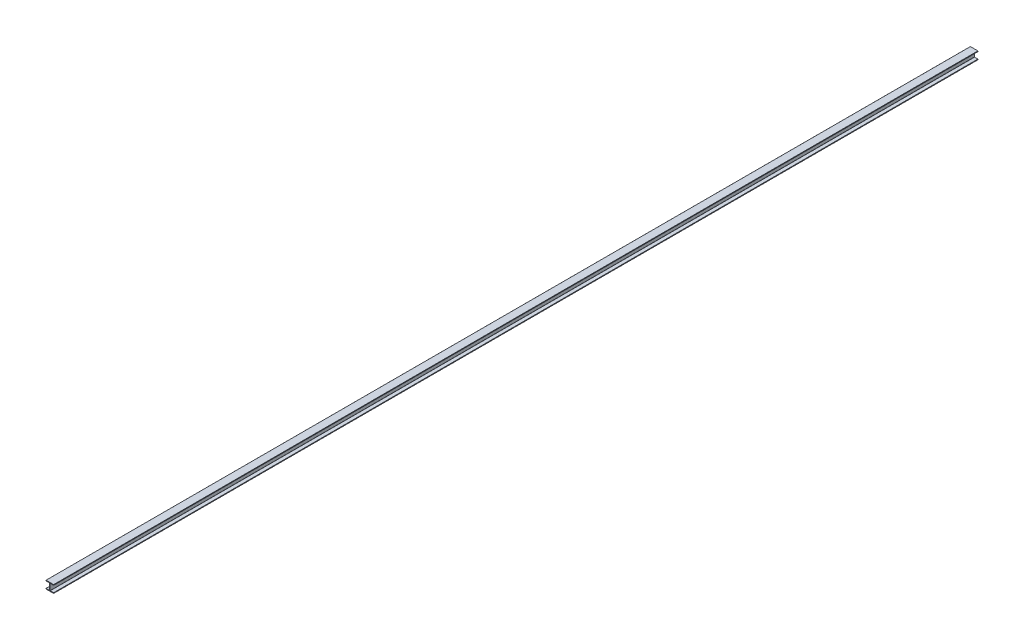
ISO-10303-21;
HEADER;
FILE_DESCRIPTION(('STEP AP214'),'2;1');
FILE_NAME('part.step','',(''),(''),'','','');
FILE_SCHEMA(('AUTOMOTIVE_DESIGN { 1 0 10303 214 1 1 1 1 }'));
ENDSEC;
DATA;
#1=APPLICATION_CONTEXT('core data for automotive mechanical design processes');
#2=APPLICATION_PROTOCOL_DEFINITION('international standard','automotive_design',2000,#1);
#3=PRODUCT_CONTEXT('',#1,'mechanical');
#4=PRODUCT('Part','Part','',(#3));
#5=PRODUCT_RELATED_PRODUCT_CATEGORY('part','',(#4));
#6=PRODUCT_DEFINITION_FORMATION('','',#4);
#7=PRODUCT_DEFINITION_CONTEXT('part definition',#1,'design');
#8=PRODUCT_DEFINITION('design','',#6,#7);
#9=PRODUCT_DEFINITION_SHAPE('','',#8);
#10=(LENGTH_UNIT() NAMED_UNIT(*) SI_UNIT(.MILLI.,.METRE.));
#11=(NAMED_UNIT(*) PLANE_ANGLE_UNIT() SI_UNIT($,.RADIAN.));
#12=(NAMED_UNIT(*) SI_UNIT($,.STERADIAN.) SOLID_ANGLE_UNIT());
#13=UNCERTAINTY_MEASURE_WITH_UNIT(LENGTH_MEASURE(1.E-05),#10,'distance_accuracy_value','');
#14=(GEOMETRIC_REPRESENTATION_CONTEXT(3) GLOBAL_UNCERTAINTY_ASSIGNED_CONTEXT((#13)) GLOBAL_UNIT_ASSIGNED_CONTEXT((#10,
#11,#12)) REPRESENTATION_CONTEXT('',''));
#15=CARTESIAN_POINT('',(0.,0.,0.));
#16=DIRECTION('',(0.,0.,1.));
#17=DIRECTION('',(1.,0.,0.));
#18=AXIS2_PLACEMENT_3D('',#15,#16,#17);
#19=CARTESIAN_POINT('',(-61.976,-61.976,7620.));
#20=DIRECTION('',(0.,0.,-1.));
#21=DIRECTION('',(-1.,0.,0.));
#22=AXIS2_PLACEMENT_3D('',#19,#20,#21);
#23=CYLINDRICAL_SURFACE('',#22,1.52400000000001);
#24=CARTESIAN_POINT('',(-61.976,-61.976,-7620.));
#25=DIRECTION('',(0.,0.,1.));
#26=DIRECTION('',(1.,0.,0.));
#27=AXIS2_PLACEMENT_3D('',#24,#25,#26);
#28=CIRCLE('',#27,1.52400000000001);
#29=CARTESIAN_POINT('',(-63.5,-61.976,-7620.));
#30=VERTEX_POINT('',#29);
#31=CARTESIAN_POINT('',(-61.976,-63.5,-7620.));
#32=VERTEX_POINT('',#31);
#33=EDGE_CURVE('E225',#30,#32,#28,.T.);
#34=ORIENTED_EDGE('',*,*,#33,.T.);
#35=DIRECTION('',(0.,0.,-1.));
#36=VECTOR('',#35,1.);
#37=CARTESIAN_POINT('',(-61.976,-63.5,7620.));
#38=LINE('',#37,#36);
#39=CARTESIAN_POINT('',(-61.976,-63.5,7620.));
#40=VERTEX_POINT('',#39);
#41=EDGE_CURVE('E11',#40,#32,#38,.T.);
#42=ORIENTED_EDGE('',*,*,#41,.F.);
#43=CARTESIAN_POINT('',(-61.976,-61.976,7620.));
#44=DIRECTION('',(0.,0.,1.));
#45=DIRECTION('',(1.,0.,0.));
#46=AXIS2_PLACEMENT_3D('',#43,#44,#45);
#47=CIRCLE('',#46,1.52400000000001);
#48=CARTESIAN_POINT('',(-63.5,-61.976,7620.));
#49=VERTEX_POINT('',#48);
#50=EDGE_CURVE('E271',#49,#40,#47,.T.);
#51=ORIENTED_EDGE('',*,*,#50,.F.);
#52=DIRECTION('',(0.,0.,-1.));
#53=VECTOR('',#52,1.);
#54=CARTESIAN_POINT('',(-63.5,-61.976,7620.));
#55=LINE('',#54,#53);
#56=EDGE_CURVE('E221',#49,#30,#55,.T.);
#57=ORIENTED_EDGE('',*,*,#56,.T.);
#58=EDGE_LOOP('',(#34,#42,#51,#57));
#59=FACE_BOUND('',#58,.T.);
#60=ADVANCED_FACE('F33',(#59),#23,.T.);
#61=CARTESIAN_POINT('',(61.976,-63.5,7620.));
#62=DIRECTION('',(0.,1.,0.));
#63=DIRECTION('',(-1.,0.,0.));
#64=AXIS2_PLACEMENT_3D('',#61,#62,#63);
#65=PLANE('',#64);
#66=DIRECTION('',(1.,0.,0.));
#67=VECTOR('',#66,1.);
#68=CARTESIAN_POINT('',(61.976,-63.5,-7620.));
#69=LINE('',#68,#67);
#70=CARTESIAN_POINT('',(61.976,-63.5,-7620.));
#71=VERTEX_POINT('',#70);
#72=EDGE_CURVE('E228',#32,#71,#69,.T.);
#73=ORIENTED_EDGE('',*,*,#72,.T.);
#74=DIRECTION('',(0.,0.,-1.));
#75=VECTOR('',#74,1.);
#76=CARTESIAN_POINT('',(61.976,-63.5,7620.));
#77=LINE('',#76,#75);
#78=CARTESIAN_POINT('',(61.976,-63.5,7620.));
#79=VERTEX_POINT('',#78);
#80=EDGE_CURVE('E41',#79,#71,#77,.T.);
#81=ORIENTED_EDGE('',*,*,#80,.F.);
#82=DIRECTION('',(1.,0.,0.));
#83=VECTOR('',#82,1.);
#84=CARTESIAN_POINT('',(61.976,-63.5,7620.));
#85=LINE('',#84,#83);
#86=EDGE_CURVE('E140',#40,#79,#85,.T.);
#87=ORIENTED_EDGE('',*,*,#86,.F.);
#88=ORIENTED_EDGE('',*,*,#41,.T.);
#89=EDGE_LOOP('',(#73,#81,#87,#88));
#90=FACE_BOUND('',#89,.T.);
#91=ADVANCED_FACE('F409',(#90),#65,.F.);
#92=CARTESIAN_POINT('',(61.976,-61.976,7620.));
#93=DIRECTION('',(0.,0.,-1.));
#94=DIRECTION('',(-1.,0.,0.));
#95=AXIS2_PLACEMENT_3D('',#92,#93,#94);
#96=CYLINDRICAL_SURFACE('',#95,1.52400000000001);
#97=CARTESIAN_POINT('',(61.976,-61.976,-7620.));
#98=DIRECTION('',(0.,0.,1.));
#99=DIRECTION('',(-1.,0.,0.));
#100=AXIS2_PLACEMENT_3D('',#97,#98,#99);
#101=CIRCLE('',#100,1.52400000000001);
#102=CARTESIAN_POINT('',(63.5,-61.976,-7620.));
#103=VERTEX_POINT('',#102);
#104=EDGE_CURVE('E230',#71,#103,#101,.T.);
#105=ORIENTED_EDGE('',*,*,#104,.T.);
#106=DIRECTION('',(0.,0.,-1.));
#107=VECTOR('',#106,1.);
#108=CARTESIAN_POINT('',(63.5,-61.976,7620.));
#109=LINE('',#108,#107);
#110=CARTESIAN_POINT('',(63.5,-61.976,7620.));
#111=VERTEX_POINT('',#110);
#112=EDGE_CURVE('E326',#111,#103,#109,.T.);
#113=ORIENTED_EDGE('',*,*,#112,.F.);
#114=CARTESIAN_POINT('',(61.976,-61.976,7620.));
#115=DIRECTION('',(0.,0.,1.));
#116=DIRECTION('',(-1.,0.,0.));
#117=AXIS2_PLACEMENT_3D('',#114,#115,#116);
#118=CIRCLE('',#117,1.52400000000001);
#119=EDGE_CURVE('E334',#79,#111,#118,.T.);
#120=ORIENTED_EDGE('',*,*,#119,.F.);
#121=ORIENTED_EDGE('',*,*,#80,.T.);
#122=EDGE_LOOP('',(#105,#113,#120,#121));
#123=FACE_BOUND('',#122,.T.);
#124=ADVANCED_FACE('F332',(#123),#96,.T.);
#125=CARTESIAN_POINT('',(63.5,-54.5592,7620.));
#126=DIRECTION('',(-1.,0.,0.));
#127=DIRECTION('',(0.,0.,1.));
#128=AXIS2_PLACEMENT_3D('',#125,#126,#127);
#129=PLANE('',#128);
#130=DIRECTION('',(0.,1.,0.));
#131=VECTOR('',#130,1.);
#132=CARTESIAN_POINT('',(63.5,-54.5592,-7620.));
#133=LINE('',#132,#131);
#134=CARTESIAN_POINT('',(63.5,-54.5592,-7620.));
#135=VERTEX_POINT('',#134);
#136=EDGE_CURVE('E232',#103,#135,#133,.T.);
#137=ORIENTED_EDGE('',*,*,#136,.T.);
#138=DIRECTION('',(0.,0.,-1.));
#139=VECTOR('',#138,1.);
#140=CARTESIAN_POINT('',(63.5,-54.5592,7620.));
#141=LINE('',#140,#139);
#142=CARTESIAN_POINT('',(63.5,-54.5592,7620.));
#143=VERTEX_POINT('',#142);
#144=EDGE_CURVE('E323',#143,#135,#141,.T.);
#145=ORIENTED_EDGE('',*,*,#144,.F.);
#146=DIRECTION('',(0.,1.,0.));
#147=VECTOR('',#146,1.);
#148=CARTESIAN_POINT('',(63.5,-54.5592,7620.));
#149=LINE('',#148,#147);
#150=EDGE_CURVE('E352',#111,#143,#149,.T.);
#151=ORIENTED_EDGE('',*,*,#150,.F.);
#152=ORIENTED_EDGE('',*,*,#112,.T.);
#153=EDGE_LOOP('',(#137,#145,#151,#152));
#154=FACE_BOUND('',#153,.T.);
#155=ADVANCED_FACE('F343',(#154),#129,.F.);
#156=CARTESIAN_POINT('',(61.976,-54.5592,7620.));
#157=DIRECTION('',(0.,0.,-1.));
#158=DIRECTION('',(-1.,0.,0.));
#159=AXIS2_PLACEMENT_3D('',#156,#157,#158);
#160=CYLINDRICAL_SURFACE('',#159,1.524);
#161=CARTESIAN_POINT('',(61.976,-54.5592,-7620.));
#162=DIRECTION('',(0.,0.,1.));
#163=DIRECTION('',(-1.,0.,0.));
#164=AXIS2_PLACEMENT_3D('',#161,#162,#163);
#165=CIRCLE('',#164,1.524);
#166=CARTESIAN_POINT('',(61.976,-53.0352,-7620.));
#167=VERTEX_POINT('',#166);
#168=EDGE_CURVE('E234',#135,#167,#165,.T.);
#169=ORIENTED_EDGE('',*,*,#168,.T.);
#170=DIRECTION('',(0.,0.,-1.));
#171=VECTOR('',#170,1.);
#172=CARTESIAN_POINT('',(61.976,-53.0352,7620.));
#173=LINE('',#172,#171);
#174=CARTESIAN_POINT('',(61.976,-53.0352,7620.));
#175=VERTEX_POINT('',#174);
#176=EDGE_CURVE('E320',#175,#167,#173,.T.);
#177=ORIENTED_EDGE('',*,*,#176,.F.);
#178=CARTESIAN_POINT('',(61.976,-54.5592,7620.));
#179=DIRECTION('',(0.,0.,1.));
#180=DIRECTION('',(-1.,0.,0.));
#181=AXIS2_PLACEMENT_3D('',#178,#179,#180);
#182=CIRCLE('',#181,1.524);
#183=EDGE_CURVE('E349',#143,#175,#182,.T.);
#184=ORIENTED_EDGE('',*,*,#183,.F.);
#185=ORIENTED_EDGE('',*,*,#144,.T.);
#186=EDGE_LOOP('',(#169,#177,#184,#185));
#187=FACE_BOUND('',#186,.T.);
#188=ADVANCED_FACE('F347',(#187),#160,.T.);
#189=CARTESIAN_POINT('',(6.76910000000002,-53.0352,7620.));
#190=DIRECTION('',(0.,-1.,0.));
#191=DIRECTION('',(1.,0.,0.));
#192=AXIS2_PLACEMENT_3D('',#189,#190,#191);
#193=PLANE('',#192);
#194=DIRECTION('',(-1.,0.,0.));
#195=VECTOR('',#194,1.);
#196=CARTESIAN_POINT('',(6.76910000000002,-53.0352,-7620.));
#197=LINE('',#196,#195);
#198=CARTESIAN_POINT('',(6.76910000000001,-53.0352,-7620.));
#199=VERTEX_POINT('',#198);
#200=EDGE_CURVE('E236',#167,#199,#197,.T.);
#201=ORIENTED_EDGE('',*,*,#200,.T.);
#202=DIRECTION('',(0.,0.,-1.));
#203=VECTOR('',#202,1.);
#204=CARTESIAN_POINT('',(6.76910000000001,-53.0352,7620.));
#205=LINE('',#204,#203);
#206=CARTESIAN_POINT('',(6.76910000000001,-53.0352,7620.));
#207=VERTEX_POINT('',#206);
#208=EDGE_CURVE('E317',#207,#199,#205,.T.);
#209=ORIENTED_EDGE('',*,*,#208,.F.);
#210=DIRECTION('',(-1.,0.,0.));
#211=VECTOR('',#210,1.);
#212=CARTESIAN_POINT('',(6.76910000000002,-53.0352,7620.));
#213=LINE('',#212,#211);
#214=EDGE_CURVE('E351',#175,#207,#213,.T.);
#215=ORIENTED_EDGE('',*,*,#214,.F.);
#216=ORIENTED_EDGE('',*,*,#176,.T.);
#217=EDGE_LOOP('',(#201,#209,#215,#216));
#218=FACE_BOUND('',#217,.T.);
#219=ADVANCED_FACE('F422',(#218),#193,.F.);
#220=CARTESIAN_POINT('',(6.76910000000001,-51.5112,7620.));
#221=DIRECTION('',(0.,0.,-1.));
#222=DIRECTION('',(-1.,0.,0.));
#223=AXIS2_PLACEMENT_3D('',#220,#221,#222);
#224=CYLINDRICAL_SURFACE('',#223,1.524);
#225=CARTESIAN_POINT('',(6.76910000000001,-51.5112,-7620.));
#226=DIRECTION('',(0.,0.,-1.));
#227=DIRECTION('',(1.,0.,0.));
#228=AXIS2_PLACEMENT_3D('',#225,#226,#227);
#229=CIRCLE('',#228,1.524);
#230=CARTESIAN_POINT('',(5.24510000000001,-51.5112,-7620.));
#231=VERTEX_POINT('',#230);
#232=EDGE_CURVE('E238',#199,#231,#229,.T.);
#233=ORIENTED_EDGE('',*,*,#232,.T.);
#234=DIRECTION('',(0.,0.,-1.));
#235=VECTOR('',#234,1.);
#236=CARTESIAN_POINT('',(5.24510000000001,-51.5112,7620.));
#237=LINE('',#236,#235);
#238=CARTESIAN_POINT('',(5.24510000000001,-51.5112,7620.));
#239=VERTEX_POINT('',#238);
#240=EDGE_CURVE('E314',#239,#231,#237,.T.);
#241=ORIENTED_EDGE('',*,*,#240,.F.);
#242=CARTESIAN_POINT('',(6.76910000000001,-51.5112,7620.));
#243=DIRECTION('',(0.,0.,-1.));
#244=DIRECTION('',(1.,0.,0.));
#245=AXIS2_PLACEMENT_3D('',#242,#243,#244);
#246=CIRCLE('',#245,1.524);
#247=EDGE_CURVE('E354',#207,#239,#246,.T.);
#248=ORIENTED_EDGE('',*,*,#247,.F.);
#249=ORIENTED_EDGE('',*,*,#208,.T.);
#250=EDGE_LOOP('',(#233,#241,#248,#249));
#251=FACE_BOUND('',#250,.T.);
#252=ADVANCED_FACE('F425',(#251),#224,.F.);
#253=CARTESIAN_POINT('',(5.24509999999999,51.5112,7620.));
#254=DIRECTION('',(-1.,0.,0.));
#255=DIRECTION('',(0.,-1.,0.));
#256=AXIS2_PLACEMENT_3D('',#253,#254,#255);
#257=PLANE('',#256);
#258=DIRECTION('',(0.,1.,0.));
#259=VECTOR('',#258,1.);
#260=CARTESIAN_POINT('',(5.24509999999999,51.5112,-7620.));
#261=LINE('',#260,#259);
#262=CARTESIAN_POINT('',(5.24509999999999,51.5112,-7620.));
#263=VERTEX_POINT('',#262);
#264=EDGE_CURVE('E240',#231,#263,#261,.T.);
#265=ORIENTED_EDGE('',*,*,#264,.T.);
#266=DIRECTION('',(0.,0.,-1.));
#267=VECTOR('',#266,1.);
#268=CARTESIAN_POINT('',(5.24509999999999,51.5112,7620.));
#269=LINE('',#268,#267);
#270=CARTESIAN_POINT('',(5.24509999999999,51.5112,7620.));
#271=VERTEX_POINT('',#270);
#272=EDGE_CURVE('E311',#271,#263,#269,.T.);
#273=ORIENTED_EDGE('',*,*,#272,.F.);
#274=DIRECTION('',(0.,1.,0.));
#275=VECTOR('',#274,1.);
#276=CARTESIAN_POINT('',(5.24509999999999,51.5112,7620.));
#277=LINE('',#276,#275);
#278=EDGE_CURVE('E360',#239,#271,#277,.T.);
#279=ORIENTED_EDGE('',*,*,#278,.F.);
#280=ORIENTED_EDGE('',*,*,#240,.T.);
#281=EDGE_LOOP('',(#265,#273,#279,#280));
#282=FACE_BOUND('',#281,.T.);
#283=ADVANCED_FACE('F429',(#282),#257,.F.);
#284=CARTESIAN_POINT('',(6.76909999999999,51.5112,7620.));
#285=DIRECTION('',(0.,0.,-1.));
#286=DIRECTION('',(-1.,0.,0.));
#287=AXIS2_PLACEMENT_3D('',#284,#285,#286);
#288=CYLINDRICAL_SURFACE('',#287,1.524);
#289=CARTESIAN_POINT('',(6.76909999999999,51.5112,-7620.));
#290=DIRECTION('',(0.,0.,-1.));
#291=DIRECTION('',(1.,0.,0.));
#292=AXIS2_PLACEMENT_3D('',#289,#290,#291);
#293=CIRCLE('',#292,1.524);
#294=CARTESIAN_POINT('',(6.76909999999999,53.0352,-7620.));
#295=VERTEX_POINT('',#294);
#296=EDGE_CURVE('E242',#263,#295,#293,.T.);
#297=ORIENTED_EDGE('',*,*,#296,.T.);
#298=DIRECTION('',(0.,0.,-1.));
#299=VECTOR('',#298,1.);
#300=CARTESIAN_POINT('',(6.76909999999999,53.0352,7620.));
#301=LINE('',#300,#299);
#302=CARTESIAN_POINT('',(6.76909999999999,53.0352,7620.));
#303=VERTEX_POINT('',#302);
#304=EDGE_CURVE('E308',#303,#295,#301,.T.);
#305=ORIENTED_EDGE('',*,*,#304,.F.);
#306=CARTESIAN_POINT('',(6.76909999999999,51.5112,7620.));
#307=DIRECTION('',(0.,0.,-1.));
#308=DIRECTION('',(1.,0.,0.));
#309=AXIS2_PLACEMENT_3D('',#306,#307,#308);
#310=CIRCLE('',#309,1.524);
#311=EDGE_CURVE('E362',#271,#303,#310,.T.);
#312=ORIENTED_EDGE('',*,*,#311,.F.);
#313=ORIENTED_EDGE('',*,*,#272,.T.);
#314=EDGE_LOOP('',(#297,#305,#312,#313));
#315=FACE_BOUND('',#314,.T.);
#316=ADVANCED_FACE('F433',(#315),#288,.F.);
#317=CARTESIAN_POINT('',(61.976,53.0352,7620.));
#318=DIRECTION('',(0.,1.,0.));
#319=DIRECTION('',(-1.,0.,0.));
#320=AXIS2_PLACEMENT_3D('',#317,#318,#319);
#321=PLANE('',#320);
#322=DIRECTION('',(1.,0.,0.));
#323=VECTOR('',#322,1.);
#324=CARTESIAN_POINT('',(61.976,53.0352,-7620.));
#325=LINE('',#324,#323);
#326=CARTESIAN_POINT('',(61.976,53.0352,-7620.));
#327=VERTEX_POINT('',#326);
#328=EDGE_CURVE('E244',#295,#327,#325,.T.);
#329=ORIENTED_EDGE('',*,*,#328,.T.);
#330=DIRECTION('',(0.,0.,-1.));
#331=VECTOR('',#330,1.);
#332=CARTESIAN_POINT('',(61.976,53.0352,7620.));
#333=LINE('',#332,#331);
#334=CARTESIAN_POINT('',(61.976,53.0352,7620.));
#335=VERTEX_POINT('',#334);
#336=EDGE_CURVE('E305',#335,#327,#333,.T.);
#337=ORIENTED_EDGE('',*,*,#336,.F.);
#338=DIRECTION('',(1.,0.,0.));
#339=VECTOR('',#338,1.);
#340=CARTESIAN_POINT('',(61.976,53.0352,7620.));
#341=LINE('',#340,#339);
#342=EDGE_CURVE('E364',#303,#335,#341,.T.);
#343=ORIENTED_EDGE('',*,*,#342,.F.);
#344=ORIENTED_EDGE('',*,*,#304,.T.);
#345=EDGE_LOOP('',(#329,#337,#343,#344));
#346=FACE_BOUND('',#345,.T.);
#347=ADVANCED_FACE('F437',(#346),#321,.F.);
#348=CARTESIAN_POINT('',(61.976,54.5592,7620.));
#349=DIRECTION('',(0.,0.,-1.));
#350=DIRECTION('',(-1.,0.,0.));
#351=AXIS2_PLACEMENT_3D('',#348,#349,#350);
#352=CYLINDRICAL_SURFACE('',#351,1.52399999999999);
#353=CARTESIAN_POINT('',(61.976,54.5592,-7620.));
#354=DIRECTION('',(0.,0.,1.));
#355=DIRECTION('',(-1.,0.,0.));
#356=AXIS2_PLACEMENT_3D('',#353,#354,#355);
#357=CIRCLE('',#356,1.52399999999999);
#358=CARTESIAN_POINT('',(63.5,54.5592,-7620.));
#359=VERTEX_POINT('',#358);
#360=EDGE_CURVE('E246',#327,#359,#357,.T.);
#361=ORIENTED_EDGE('',*,*,#360,.T.);
#362=DIRECTION('',(0.,0.,-1.));
#363=VECTOR('',#362,1.);
#364=CARTESIAN_POINT('',(63.5,54.5592,7620.));
#365=LINE('',#364,#363);
#366=CARTESIAN_POINT('',(63.5,54.5592,7620.));
#367=VERTEX_POINT('',#366);
#368=EDGE_CURVE('E302',#367,#359,#365,.T.);
#369=ORIENTED_EDGE('',*,*,#368,.F.);
#370=CARTESIAN_POINT('',(61.976,54.5592,7620.));
#371=DIRECTION('',(0.,0.,1.));
#372=DIRECTION('',(-1.,0.,0.));
#373=AXIS2_PLACEMENT_3D('',#370,#371,#372);
#374=CIRCLE('',#373,1.52399999999999);
#375=EDGE_CURVE('E366',#335,#367,#374,.T.);
#376=ORIENTED_EDGE('',*,*,#375,.F.);
#377=ORIENTED_EDGE('',*,*,#336,.T.);
#378=EDGE_LOOP('',(#361,#369,#376,#377));
#379=FACE_BOUND('',#378,.T.);
#380=ADVANCED_FACE('F441',(#379),#352,.T.);
#381=CARTESIAN_POINT('',(63.5,61.976,7620.));
#382=DIRECTION('',(-1.,0.,0.));
#383=DIRECTION('',(0.,0.,1.));
#384=AXIS2_PLACEMENT_3D('',#381,#382,#383);
#385=PLANE('',#384);
#386=DIRECTION('',(0.,1.,0.));
#387=VECTOR('',#386,1.);
#388=CARTESIAN_POINT('',(63.5,61.976,-7620.));
#389=LINE('',#388,#387);
#390=CARTESIAN_POINT('',(63.5,61.976,-7620.));
#391=VERTEX_POINT('',#390);
#392=EDGE_CURVE('E248',#359,#391,#389,.T.);
#393=ORIENTED_EDGE('',*,*,#392,.T.);
#394=DIRECTION('',(0.,0.,-1.));
#395=VECTOR('',#394,1.);
#396=CARTESIAN_POINT('',(63.5,61.976,7620.));
#397=LINE('',#396,#395);
#398=CARTESIAN_POINT('',(63.5,61.976,7620.));
#399=VERTEX_POINT('',#398);
#400=EDGE_CURVE('E299',#399,#391,#397,.T.);
#401=ORIENTED_EDGE('',*,*,#400,.F.);
#402=DIRECTION('',(0.,1.,0.));
#403=VECTOR('',#402,1.);
#404=CARTESIAN_POINT('',(63.5,61.976,7620.));
#405=LINE('',#404,#403);
#406=EDGE_CURVE('E368',#367,#399,#405,.T.);
#407=ORIENTED_EDGE('',*,*,#406,.F.);
#408=ORIENTED_EDGE('',*,*,#368,.T.);
#409=EDGE_LOOP('',(#393,#401,#407,#408));
#410=FACE_BOUND('',#409,.T.);
#411=ADVANCED_FACE('F445',(#410),#385,.F.);
#412=CARTESIAN_POINT('',(61.976,61.976,7620.));
#413=DIRECTION('',(0.,0.,-1.));
#414=DIRECTION('',(-1.,0.,0.));
#415=AXIS2_PLACEMENT_3D('',#412,#413,#414);
#416=CYLINDRICAL_SURFACE('',#415,1.52400000000001);
#417=CARTESIAN_POINT('',(61.976,61.976,-7620.));
#418=DIRECTION('',(0.,0.,1.));
#419=DIRECTION('',(-1.,0.,0.));
#420=AXIS2_PLACEMENT_3D('',#417,#418,#419);
#421=CIRCLE('',#420,1.52400000000001);
#422=CARTESIAN_POINT('',(61.976,63.5,-7620.));
#423=VERTEX_POINT('',#422);
#424=EDGE_CURVE('E250',#391,#423,#421,.T.);
#425=ORIENTED_EDGE('',*,*,#424,.T.);
#426=DIRECTION('',(0.,0.,-1.));
#427=VECTOR('',#426,1.);
#428=CARTESIAN_POINT('',(61.976,63.5,7620.));
#429=LINE('',#428,#427);
#430=CARTESIAN_POINT('',(61.976,63.5,7620.));
#431=VERTEX_POINT('',#430);
#432=EDGE_CURVE('E296',#431,#423,#429,.T.);
#433=ORIENTED_EDGE('',*,*,#432,.F.);
#434=CARTESIAN_POINT('',(61.976,61.976,7620.));
#435=DIRECTION('',(0.,0.,1.));
#436=DIRECTION('',(-1.,0.,0.));
#437=AXIS2_PLACEMENT_3D('',#434,#435,#436);
#438=CIRCLE('',#437,1.52400000000001);
#439=EDGE_CURVE('E370',#399,#431,#438,.T.);
#440=ORIENTED_EDGE('',*,*,#439,.F.);
#441=ORIENTED_EDGE('',*,*,#400,.T.);
#442=EDGE_LOOP('',(#425,#433,#440,#441));
#443=FACE_BOUND('',#442,.T.);
#444=ADVANCED_FACE('F449',(#443),#416,.T.);
#445=CARTESIAN_POINT('',(-61.976,63.5,7620.));
#446=DIRECTION('',(0.,-1.,0.));
#447=DIRECTION('',(1.,0.,0.));
#448=AXIS2_PLACEMENT_3D('',#445,#446,#447);
#449=PLANE('',#448);
#450=DIRECTION('',(-1.,0.,0.));
#451=VECTOR('',#450,1.);
#452=CARTESIAN_POINT('',(-61.976,63.5,-7620.));
#453=LINE('',#452,#451);
#454=CARTESIAN_POINT('',(-61.976,63.5,-7620.));
#455=VERTEX_POINT('',#454);
#456=EDGE_CURVE('E252',#423,#455,#453,.T.);
#457=ORIENTED_EDGE('',*,*,#456,.T.);
#458=DIRECTION('',(0.,0.,-1.));
#459=VECTOR('',#458,1.);
#460=CARTESIAN_POINT('',(-61.976,63.5,7620.));
#461=LINE('',#460,#459);
#462=CARTESIAN_POINT('',(-61.976,63.5,7620.));
#463=VERTEX_POINT('',#462);
#464=EDGE_CURVE('E293',#463,#455,#461,.T.);
#465=ORIENTED_EDGE('',*,*,#464,.F.);
#466=DIRECTION('',(-1.,0.,0.));
#467=VECTOR('',#466,1.);
#468=CARTESIAN_POINT('',(-61.976,63.5,7620.));
#469=LINE('',#468,#467);
#470=EDGE_CURVE('E372',#431,#463,#469,.T.);
#471=ORIENTED_EDGE('',*,*,#470,.F.);
#472=ORIENTED_EDGE('',*,*,#432,.T.);
#473=EDGE_LOOP('',(#457,#465,#471,#472));
#474=FACE_BOUND('',#473,.T.);
#475=ADVANCED_FACE('F453',(#474),#449,.F.);
#476=CARTESIAN_POINT('',(-61.976,61.976,7620.));
#477=DIRECTION('',(0.,0.,-1.));
#478=DIRECTION('',(-1.,0.,0.));
#479=AXIS2_PLACEMENT_3D('',#476,#477,#478);
#480=CYLINDRICAL_SURFACE('',#479,1.52400000000001);
#481=CARTESIAN_POINT('',(-61.976,61.976,-7620.));
#482=DIRECTION('',(0.,0.,1.));
#483=DIRECTION('',(-1.,0.,0.));
#484=AXIS2_PLACEMENT_3D('',#481,#482,#483);
#485=CIRCLE('',#484,1.52400000000001);
#486=CARTESIAN_POINT('',(-63.5,61.976,-7620.));
#487=VERTEX_POINT('',#486);
#488=EDGE_CURVE('E254',#455,#487,#485,.T.);
#489=ORIENTED_EDGE('',*,*,#488,.T.);
#490=DIRECTION('',(0.,0.,-1.));
#491=VECTOR('',#490,1.);
#492=CARTESIAN_POINT('',(-63.5,61.976,7620.));
#493=LINE('',#492,#491);
#494=CARTESIAN_POINT('',(-63.5,61.976,7620.));
#495=VERTEX_POINT('',#494);
#496=EDGE_CURVE('E290',#495,#487,#493,.T.);
#497=ORIENTED_EDGE('',*,*,#496,.F.);
#498=CARTESIAN_POINT('',(-61.976,61.976,7620.));
#499=DIRECTION('',(0.,0.,1.));
#500=DIRECTION('',(-1.,0.,0.));
#501=AXIS2_PLACEMENT_3D('',#498,#499,#500);
#502=CIRCLE('',#501,1.52400000000001);
#503=EDGE_CURVE('E374',#463,#495,#502,.T.);
#504=ORIENTED_EDGE('',*,*,#503,.F.);
#505=ORIENTED_EDGE('',*,*,#464,.T.);
#506=EDGE_LOOP('',(#489,#497,#504,#505));
#507=FACE_BOUND('',#506,.T.);
#508=ADVANCED_FACE('F457',(#507),#480,.T.);
#509=CARTESIAN_POINT('',(-63.5,54.5592,7620.));
#510=DIRECTION('',(1.,0.,0.));
#511=DIRECTION('',(0.,0.,-1.));
#512=AXIS2_PLACEMENT_3D('',#509,#510,#511);
#513=PLANE('',#512);
#514=DIRECTION('',(0.,-1.,0.));
#515=VECTOR('',#514,1.);
#516=CARTESIAN_POINT('',(-63.5,54.5592,-7620.));
#517=LINE('',#516,#515);
#518=CARTESIAN_POINT('',(-63.5,54.5592,-7620.));
#519=VERTEX_POINT('',#518);
#520=EDGE_CURVE('E256',#487,#519,#517,.T.);
#521=ORIENTED_EDGE('',*,*,#520,.T.);
#522=DIRECTION('',(0.,0.,-1.));
#523=VECTOR('',#522,1.);
#524=CARTESIAN_POINT('',(-63.5,54.5592,7620.));
#525=LINE('',#524,#523);
#526=CARTESIAN_POINT('',(-63.5,54.5592,7620.));
#527=VERTEX_POINT('',#526);
#528=EDGE_CURVE('E287',#527,#519,#525,.T.);
#529=ORIENTED_EDGE('',*,*,#528,.F.);
#530=DIRECTION('',(0.,-1.,0.));
#531=VECTOR('',#530,1.);
#532=CARTESIAN_POINT('',(-63.5,54.5592,7620.));
#533=LINE('',#532,#531);
#534=EDGE_CURVE('E376',#495,#527,#533,.T.);
#535=ORIENTED_EDGE('',*,*,#534,.F.);
#536=ORIENTED_EDGE('',*,*,#496,.T.);
#537=EDGE_LOOP('',(#521,#529,#535,#536));
#538=FACE_BOUND('',#537,.T.);
#539=ADVANCED_FACE('F461',(#538),#513,.F.);
#540=CARTESIAN_POINT('',(-61.976,54.5592,7620.));
#541=DIRECTION('',(0.,0.,-1.));
#542=DIRECTION('',(-1.,0.,0.));
#543=AXIS2_PLACEMENT_3D('',#540,#541,#542);
#544=CYLINDRICAL_SURFACE('',#543,1.524);
#545=CARTESIAN_POINT('',(-61.976,54.5592,-7620.));
#546=DIRECTION('',(0.,0.,1.));
#547=DIRECTION('',(-1.,0.,0.));
#548=AXIS2_PLACEMENT_3D('',#545,#546,#547);
#549=CIRCLE('',#548,1.524);
#550=CARTESIAN_POINT('',(-61.976,53.0352,-7620.));
#551=VERTEX_POINT('',#550);
#552=EDGE_CURVE('E258',#519,#551,#549,.T.);
#553=ORIENTED_EDGE('',*,*,#552,.T.);
#554=DIRECTION('',(0.,0.,-1.));
#555=VECTOR('',#554,1.);
#556=CARTESIAN_POINT('',(-61.976,53.0352,7620.));
#557=LINE('',#556,#555);
#558=CARTESIAN_POINT('',(-61.976,53.0352,7620.));
#559=VERTEX_POINT('',#558);
#560=EDGE_CURVE('E284',#559,#551,#557,.T.);
#561=ORIENTED_EDGE('',*,*,#560,.F.);
#562=CARTESIAN_POINT('',(-61.976,54.5592,7620.));
#563=DIRECTION('',(0.,0.,1.));
#564=DIRECTION('',(-1.,0.,0.));
#565=AXIS2_PLACEMENT_3D('',#562,#563,#564);
#566=CIRCLE('',#565,1.524);
#567=EDGE_CURVE('E378',#527,#559,#566,.T.);
#568=ORIENTED_EDGE('',*,*,#567,.F.);
#569=ORIENTED_EDGE('',*,*,#528,.T.);
#570=EDGE_LOOP('',(#553,#561,#568,#569));
#571=FACE_BOUND('',#570,.T.);
#572=ADVANCED_FACE('F465',(#571),#544,.T.);
#573=CARTESIAN_POINT('',(-6.76909999999999,53.0352,7620.));
#574=DIRECTION('',(0.,1.,0.));
#575=DIRECTION('',(-1.,0.,0.));
#576=AXIS2_PLACEMENT_3D('',#573,#574,#575);
#577=PLANE('',#576);
#578=DIRECTION('',(1.,0.,0.));
#579=VECTOR('',#578,1.);
#580=CARTESIAN_POINT('',(-6.76909999999999,53.0352,-7620.));
#581=LINE('',#580,#579);
#582=CARTESIAN_POINT('',(-6.76909999999999,53.0352,-7620.));
#583=VERTEX_POINT('',#582);
#584=EDGE_CURVE('E260',#551,#583,#581,.T.);
#585=ORIENTED_EDGE('',*,*,#584,.T.);
#586=DIRECTION('',(0.,0.,-1.));
#587=VECTOR('',#586,1.);
#588=CARTESIAN_POINT('',(-6.76909999999999,53.0352,7620.));
#589=LINE('',#588,#587);
#590=CARTESIAN_POINT('',(-6.76909999999999,53.0352,7620.));
#591=VERTEX_POINT('',#590);
#592=EDGE_CURVE('E281',#591,#583,#589,.T.);
#593=ORIENTED_EDGE('',*,*,#592,.F.);
#594=DIRECTION('',(1.,0.,0.));
#595=VECTOR('',#594,1.);
#596=CARTESIAN_POINT('',(-6.76909999999999,53.0352,7620.));
#597=LINE('',#596,#595);
#598=EDGE_CURVE('E380',#559,#591,#597,.T.);
#599=ORIENTED_EDGE('',*,*,#598,.F.);
#600=ORIENTED_EDGE('',*,*,#560,.T.);
#601=EDGE_LOOP('',(#585,#593,#599,#600));
#602=FACE_BOUND('',#601,.T.);
#603=ADVANCED_FACE('F469',(#602),#577,.F.);
#604=CARTESIAN_POINT('',(-6.76909999999999,51.5112,7620.));
#605=DIRECTION('',(0.,0.,-1.));
#606=DIRECTION('',(-1.,0.,0.));
#607=AXIS2_PLACEMENT_3D('',#604,#605,#606);
#608=CYLINDRICAL_SURFACE('',#607,1.524);
#609=CARTESIAN_POINT('',(-6.76909999999999,51.5112,-7620.));
#610=DIRECTION('',(0.,0.,-1.));
#611=DIRECTION('',(1.,0.,0.));
#612=AXIS2_PLACEMENT_3D('',#609,#610,#611);
#613=CIRCLE('',#612,1.524);
#614=CARTESIAN_POINT('',(-5.24509999999999,51.5112,-7620.));
#615=VERTEX_POINT('',#614);
#616=EDGE_CURVE('E262',#583,#615,#613,.T.);
#617=ORIENTED_EDGE('',*,*,#616,.T.);
#618=DIRECTION('',(0.,0.,-1.));
#619=VECTOR('',#618,1.);
#620=CARTESIAN_POINT('',(-5.24509999999999,51.5112,7620.));
#621=LINE('',#620,#619);
#622=CARTESIAN_POINT('',(-5.24509999999999,51.5112,7620.));
#623=VERTEX_POINT('',#622);
#624=EDGE_CURVE('E278',#623,#615,#621,.T.);
#625=ORIENTED_EDGE('',*,*,#624,.F.);
#626=CARTESIAN_POINT('',(-6.76909999999999,51.5112,7620.));
#627=DIRECTION('',(0.,0.,-1.));
#628=DIRECTION('',(1.,0.,0.));
#629=AXIS2_PLACEMENT_3D('',#626,#627,#628);
#630=CIRCLE('',#629,1.524);
#631=EDGE_CURVE('E382',#591,#623,#630,.T.);
#632=ORIENTED_EDGE('',*,*,#631,.F.);
#633=ORIENTED_EDGE('',*,*,#592,.T.);
#634=EDGE_LOOP('',(#617,#625,#632,#633));
#635=FACE_BOUND('',#634,.T.);
#636=ADVANCED_FACE('F473',(#635),#608,.F.);
#637=CARTESIAN_POINT('',(-5.24509999999999,-51.5112,7620.));
#638=DIRECTION('',(1.,0.,0.));
#639=DIRECTION('',(0.,0.,-1.));
#640=AXIS2_PLACEMENT_3D('',#637,#638,#639);
#641=PLANE('',#640);
#642=DIRECTION('',(0.,-1.,0.));
#643=VECTOR('',#642,1.);
#644=CARTESIAN_POINT('',(-5.24509999999999,-51.5112,-7620.));
#645=LINE('',#644,#643);
#646=CARTESIAN_POINT('',(-5.24509999999999,-51.5112,-7620.));
#647=VERTEX_POINT('',#646);
#648=EDGE_CURVE('E264',#615,#647,#645,.T.);
#649=ORIENTED_EDGE('',*,*,#648,.T.);
#650=DIRECTION('',(0.,0.,-1.));
#651=VECTOR('',#650,1.);
#652=CARTESIAN_POINT('',(-5.24509999999999,-51.5112,7620.));
#653=LINE('',#652,#651);
#654=CARTESIAN_POINT('',(-5.24509999999999,-51.5112,7620.));
#655=VERTEX_POINT('',#654);
#656=EDGE_CURVE('E275',#655,#647,#653,.T.);
#657=ORIENTED_EDGE('',*,*,#656,.F.);
#658=DIRECTION('',(0.,-1.,0.));
#659=VECTOR('',#658,1.);
#660=CARTESIAN_POINT('',(-5.24509999999999,-51.5112,7620.));
#661=LINE('',#660,#659);
#662=EDGE_CURVE('E384',#623,#655,#661,.T.);
#663=ORIENTED_EDGE('',*,*,#662,.F.);
#664=ORIENTED_EDGE('',*,*,#624,.T.);
#665=EDGE_LOOP('',(#649,#657,#663,#664));
#666=FACE_BOUND('',#665,.T.);
#667=ADVANCED_FACE('F390',(#666),#641,.F.);
#668=CARTESIAN_POINT('',(-6.76909999999999,-51.5112,7620.));
#669=DIRECTION('',(0.,0.,-1.));
#670=DIRECTION('',(-1.,0.,0.));
#671=AXIS2_PLACEMENT_3D('',#668,#669,#670);
#672=CYLINDRICAL_SURFACE('',#671,1.524);
#673=CARTESIAN_POINT('',(-6.76909999999999,-51.5112,-7620.));
#674=DIRECTION('',(0.,0.,-1.));
#675=DIRECTION('',(1.,0.,0.));
#676=AXIS2_PLACEMENT_3D('',#673,#674,#675);
#677=CIRCLE('',#676,1.524);
#678=CARTESIAN_POINT('',(-6.76909999999999,-53.0352,-7620.));
#679=VERTEX_POINT('',#678);
#680=EDGE_CURVE('E266',#647,#679,#677,.T.);
#681=ORIENTED_EDGE('',*,*,#680,.T.);
#682=DIRECTION('',(0.,0.,-1.));
#683=VECTOR('',#682,1.);
#684=CARTESIAN_POINT('',(-6.76909999999999,-53.0352,7620.));
#685=LINE('',#684,#683);
#686=CARTESIAN_POINT('',(-6.76909999999999,-53.0352,7620.));
#687=VERTEX_POINT('',#686);
#688=EDGE_CURVE('E216',#687,#679,#685,.T.);
#689=ORIENTED_EDGE('',*,*,#688,.F.);
#690=CARTESIAN_POINT('',(-6.76909999999999,-51.5112,7620.));
#691=DIRECTION('',(0.,0.,-1.));
#692=DIRECTION('',(1.,0.,0.));
#693=AXIS2_PLACEMENT_3D('',#690,#691,#692);
#694=CIRCLE('',#693,1.524);
#695=EDGE_CURVE('E207',#655,#687,#694,.T.);
#696=ORIENTED_EDGE('',*,*,#695,.F.);
#697=ORIENTED_EDGE('',*,*,#656,.T.);
#698=EDGE_LOOP('',(#681,#689,#696,#697));
#699=FACE_BOUND('',#698,.T.);
#700=ADVANCED_FACE('F394',(#699),#672,.F.);
#701=CARTESIAN_POINT('',(-61.976,-53.0352,7620.));
#702=DIRECTION('',(0.,-1.,0.));
#703=DIRECTION('',(1.,0.,0.));
#704=AXIS2_PLACEMENT_3D('',#701,#702,#703);
#705=PLANE('',#704);
#706=DIRECTION('',(-1.,0.,0.));
#707=VECTOR('',#706,1.);
#708=CARTESIAN_POINT('',(-61.976,-53.0352,-7620.));
#709=LINE('',#708,#707);
#710=CARTESIAN_POINT('',(-61.976,-53.0352,-7620.));
#711=VERTEX_POINT('',#710);
#712=EDGE_CURVE('E215',#679,#711,#709,.T.);
#713=ORIENTED_EDGE('',*,*,#712,.T.);
#714=DIRECTION('',(0.,0.,-1.));
#715=VECTOR('',#714,1.);
#716=CARTESIAN_POINT('',(-61.976,-53.0352,7620.));
#717=LINE('',#716,#715);
#718=CARTESIAN_POINT('',(-61.976,-53.0352,7620.));
#719=VERTEX_POINT('',#718);
#720=EDGE_CURVE('E212',#719,#711,#717,.T.);
#721=ORIENTED_EDGE('',*,*,#720,.F.);
#722=DIRECTION('',(-1.,0.,0.));
#723=VECTOR('',#722,1.);
#724=CARTESIAN_POINT('',(-61.976,-53.0352,7620.));
#725=LINE('',#724,#723);
#726=EDGE_CURVE('E201',#687,#719,#725,.T.);
#727=ORIENTED_EDGE('',*,*,#726,.F.);
#728=ORIENTED_EDGE('',*,*,#688,.T.);
#729=EDGE_LOOP('',(#713,#721,#727,#728));
#730=FACE_BOUND('',#729,.T.);
#731=ADVANCED_FACE('F213',(#730),#705,.F.);
#732=CARTESIAN_POINT('',(-61.976,-54.5592,7620.));
#733=DIRECTION('',(0.,0.,-1.));
#734=DIRECTION('',(-1.,0.,0.));
#735=AXIS2_PLACEMENT_3D('',#732,#733,#734);
#736=CYLINDRICAL_SURFACE('',#735,1.524);
#737=CARTESIAN_POINT('',(-61.976,-54.5592,-7620.));
#738=DIRECTION('',(0.,0.,1.));
#739=DIRECTION('',(-1.,0.,0.));
#740=AXIS2_PLACEMENT_3D('',#737,#738,#739);
#741=CIRCLE('',#740,1.524);
#742=CARTESIAN_POINT('',(-63.5,-54.5592,-7620.));
#743=VERTEX_POINT('',#742);
#744=EDGE_CURVE('E126',#711,#743,#741,.T.);
#745=ORIENTED_EDGE('',*,*,#744,.T.);
#746=DIRECTION('',(0.,0.,-1.));
#747=VECTOR('',#746,1.);
#748=CARTESIAN_POINT('',(-63.5,-54.5592,7620.));
#749=LINE('',#748,#747);
#750=CARTESIAN_POINT('',(-63.5,-54.5592,7620.));
#751=VERTEX_POINT('',#750);
#752=EDGE_CURVE('E217',#751,#743,#749,.T.);
#753=ORIENTED_EDGE('',*,*,#752,.F.);
#754=CARTESIAN_POINT('',(-61.976,-54.5592,7620.));
#755=DIRECTION('',(0.,0.,1.));
#756=DIRECTION('',(-1.,0.,0.));
#757=AXIS2_PLACEMENT_3D('',#754,#755,#756);
#758=CIRCLE('',#757,1.524);
#759=EDGE_CURVE('E205',#719,#751,#758,.T.);
#760=ORIENTED_EDGE('',*,*,#759,.F.);
#761=ORIENTED_EDGE('',*,*,#720,.T.);
#762=EDGE_LOOP('',(#745,#753,#760,#761));
#763=FACE_BOUND('',#762,.T.);
#764=ADVANCED_FACE('F219',(#763),#736,.T.);
#765=CARTESIAN_POINT('',(-63.5,-61.976,7620.));
#766=DIRECTION('',(1.,0.,0.));
#767=DIRECTION('',(0.,0.,-1.));
#768=AXIS2_PLACEMENT_3D('',#765,#766,#767);
#769=PLANE('',#768);
#770=DIRECTION('',(0.,-1.,0.));
#771=VECTOR('',#770,1.);
#772=CARTESIAN_POINT('',(-63.5,-61.976,-7620.));
#773=LINE('',#772,#771);
#774=EDGE_CURVE('E132',#743,#30,#773,.T.);
#775=ORIENTED_EDGE('',*,*,#774,.T.);
#776=ORIENTED_EDGE('',*,*,#56,.F.);
#777=DIRECTION('',(0.,-1.,0.));
#778=VECTOR('',#777,1.);
#779=CARTESIAN_POINT('',(-63.5,-61.976,7620.));
#780=LINE('',#779,#778);
#781=EDGE_CURVE('E49',#751,#49,#780,.T.);
#782=ORIENTED_EDGE('',*,*,#781,.F.);
#783=ORIENTED_EDGE('',*,*,#752,.T.);
#784=EDGE_LOOP('',(#775,#776,#782,#783));
#785=FACE_BOUND('',#784,.T.);
#786=ADVANCED_FACE('F398',(#785),#769,.F.);
#787=CARTESIAN_POINT('',(-61.976,-61.976,7620.));
#788=DIRECTION('',(0.,0.,1.));
#789=DIRECTION('',(1.,0.,0.));
#790=AXIS2_PLACEMENT_3D('',#787,#788,#789);
#791=PLANE('',#790);
#792=ORIENTED_EDGE('',*,*,#50,.T.);
#793=ORIENTED_EDGE('',*,*,#86,.T.);
#794=ORIENTED_EDGE('',*,*,#119,.T.);
#795=ORIENTED_EDGE('',*,*,#150,.T.);
#796=ORIENTED_EDGE('',*,*,#183,.T.);
#797=ORIENTED_EDGE('',*,*,#214,.T.);
#798=ORIENTED_EDGE('',*,*,#247,.T.);
#799=ORIENTED_EDGE('',*,*,#278,.T.);
#800=ORIENTED_EDGE('',*,*,#311,.T.);
#801=ORIENTED_EDGE('',*,*,#342,.T.);
#802=ORIENTED_EDGE('',*,*,#375,.T.);
#803=ORIENTED_EDGE('',*,*,#406,.T.);
#804=ORIENTED_EDGE('',*,*,#439,.T.);
#805=ORIENTED_EDGE('',*,*,#470,.T.);
#806=ORIENTED_EDGE('',*,*,#503,.T.);
#807=ORIENTED_EDGE('',*,*,#534,.T.);
#808=ORIENTED_EDGE('',*,*,#567,.T.);
#809=ORIENTED_EDGE('',*,*,#598,.T.);
#810=ORIENTED_EDGE('',*,*,#631,.T.);
#811=ORIENTED_EDGE('',*,*,#662,.T.);
#812=ORIENTED_EDGE('',*,*,#695,.T.);
#813=ORIENTED_EDGE('',*,*,#726,.T.);
#814=ORIENTED_EDGE('',*,*,#759,.T.);
#815=ORIENTED_EDGE('',*,*,#781,.T.);
#816=EDGE_LOOP('',(#792,#793,#794,#795,#796,#797,#798,#799,#800,#801,#802,#803,#804,#805,#806,
#807,#808,#809,#810,#811,#812,#813,#814,#815));
#817=FACE_BOUND('',#816,.T.);
#818=ADVANCED_FACE('F203',(#817),#791,.T.);
#819=CARTESIAN_POINT('',(-61.976,-61.976,-7620.));
#820=DIRECTION('',(0.,0.,1.));
#821=DIRECTION('',(1.,0.,0.));
#822=AXIS2_PLACEMENT_3D('',#819,#820,#821);
#823=PLANE('',#822);
#824=ORIENTED_EDGE('',*,*,#33,.F.);
#825=ORIENTED_EDGE('',*,*,#774,.F.);
#826=ORIENTED_EDGE('',*,*,#744,.F.);
#827=ORIENTED_EDGE('',*,*,#712,.F.);
#828=ORIENTED_EDGE('',*,*,#680,.F.);
#829=ORIENTED_EDGE('',*,*,#648,.F.);
#830=ORIENTED_EDGE('',*,*,#616,.F.);
#831=ORIENTED_EDGE('',*,*,#584,.F.);
#832=ORIENTED_EDGE('',*,*,#552,.F.);
#833=ORIENTED_EDGE('',*,*,#520,.F.);
#834=ORIENTED_EDGE('',*,*,#488,.F.);
#835=ORIENTED_EDGE('',*,*,#456,.F.);
#836=ORIENTED_EDGE('',*,*,#424,.F.);
#837=ORIENTED_EDGE('',*,*,#392,.F.);
#838=ORIENTED_EDGE('',*,*,#360,.F.);
#839=ORIENTED_EDGE('',*,*,#328,.F.);
#840=ORIENTED_EDGE('',*,*,#296,.F.);
#841=ORIENTED_EDGE('',*,*,#264,.F.);
#842=ORIENTED_EDGE('',*,*,#232,.F.);
#843=ORIENTED_EDGE('',*,*,#200,.F.);
#844=ORIENTED_EDGE('',*,*,#168,.F.);
#845=ORIENTED_EDGE('',*,*,#136,.F.);
#846=ORIENTED_EDGE('',*,*,#104,.F.);
#847=ORIENTED_EDGE('',*,*,#72,.F.);
#848=EDGE_LOOP('',(#824,#825,#826,#827,#828,#829,#830,#831,#832,#833,#834,#835,#836,#837,#838,
#839,#840,#841,#842,#843,#844,#845,#846,#847));
#849=FACE_BOUND('',#848,.T.);
#850=ADVANCED_FACE('F338',(#849),#823,.F.);
#851=CLOSED_SHELL('',(#60,#91,#124,#155,#188,#219,#252,#283,#316,#347,#380,#411,#444,#475,#508,
#539,#572,#603,#636,#667,#700,#731,#764,#786,#818,#850));
#852=MANIFOLD_SOLID_BREP('B2',#851);
#853=ADVANCED_BREP_SHAPE_REPRESENTATION('',(#18,#852),#14);
#854=SHAPE_DEFINITION_REPRESENTATION(#9,#853);
ENDSEC;
END-ISO-10303-21;
